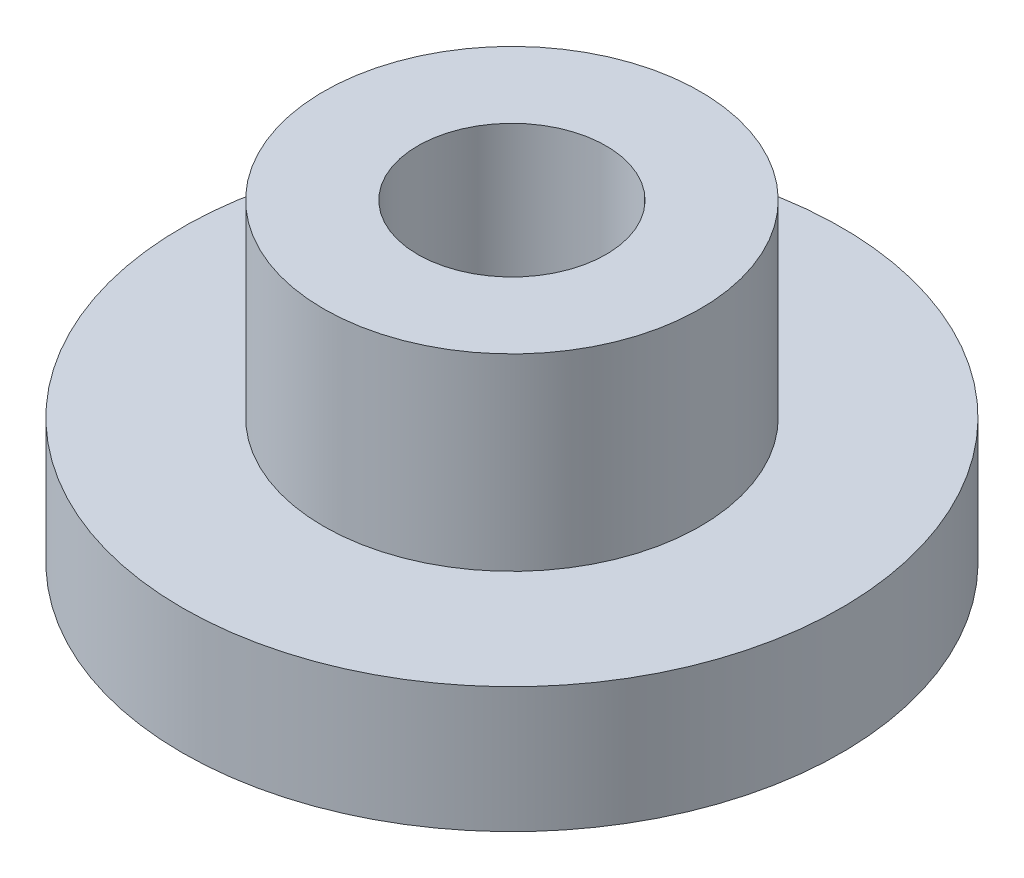
ISO-10303-21;
HEADER;
FILE_DESCRIPTION(('STEP AP214'),'2;1');
FILE_NAME('part.step','',(''),(''),'','','');
FILE_SCHEMA(('AUTOMOTIVE_DESIGN { 1 0 10303 214 1 1 1 1 }'));
ENDSEC;
DATA;
#1=APPLICATION_CONTEXT('core data for automotive mechanical design processes');
#2=APPLICATION_PROTOCOL_DEFINITION('international standard','automotive_design',2000,#1);
#3=PRODUCT_CONTEXT('',#1,'mechanical');
#4=PRODUCT('Part','Part','',(#3));
#5=PRODUCT_RELATED_PRODUCT_CATEGORY('part','',(#4));
#6=PRODUCT_DEFINITION_FORMATION('','',#4);
#7=PRODUCT_DEFINITION_CONTEXT('part definition',#1,'design');
#8=PRODUCT_DEFINITION('design','',#6,#7);
#9=PRODUCT_DEFINITION_SHAPE('','',#8);
#10=(LENGTH_UNIT() NAMED_UNIT(*) SI_UNIT(.MILLI.,.METRE.));
#11=(NAMED_UNIT(*) PLANE_ANGLE_UNIT() SI_UNIT($,.RADIAN.));
#12=(NAMED_UNIT(*) SI_UNIT($,.STERADIAN.) SOLID_ANGLE_UNIT());
#13=UNCERTAINTY_MEASURE_WITH_UNIT(LENGTH_MEASURE(1.E-05),#10,'distance_accuracy_value','');
#14=(GEOMETRIC_REPRESENTATION_CONTEXT(3) GLOBAL_UNCERTAINTY_ASSIGNED_CONTEXT((#13)) GLOBAL_UNIT_ASSIGNED_CONTEXT((#10,
#11,#12)) REPRESENTATION_CONTEXT('',''));
#15=CARTESIAN_POINT('',(0.,0.,0.));
#16=DIRECTION('',(0.,0.,1.));
#17=DIRECTION('',(1.,0.,0.));
#18=AXIS2_PLACEMENT_3D('',#15,#16,#17);
#19=CARTESIAN_POINT('',(0.,-2.,0.));
#20=DIRECTION('',(0.,-1.,0.));
#21=DIRECTION('',(0.,0.,-1.));
#22=AXIS2_PLACEMENT_3D('',#19,#20,#21);
#23=PLANE('',#22);
#24=CARTESIAN_POINT('',(0.,-2.,0.));
#25=DIRECTION('',(0.,1.,0.));
#26=DIRECTION('',(0.,0.,1.));
#27=AXIS2_PLACEMENT_3D('',#24,#25,#26);
#28=CIRCLE('',#27,5.24999999999999);
#29=CARTESIAN_POINT('',(0.,-2.,5.24999999999999));
#30=VERTEX_POINT('',#29);
#31=EDGE_CURVE('E11',#30,#30,#28,.T.);
#32=ORIENTED_EDGE('',*,*,#31,.F.);
#33=EDGE_LOOP('',(#32));
#34=FACE_BOUND('',#33,.T.);
#35=ADVANCED_FACE('F32',(#34),#23,.T.);
#36=CARTESIAN_POINT('',(0.,27.2702561117579,0.));
#37=DIRECTION('',(0.,1.,0.));
#38=DIRECTION('',(0.,0.,1.));
#39=AXIS2_PLACEMENT_3D('',#36,#37,#38);
#40=CYLINDRICAL_SURFACE('',#39,5.24999999999999);
#41=ORIENTED_EDGE('',*,*,#31,.T.);
#42=EDGE_LOOP('',(#41));
#43=FACE_BOUND('',#42,.T.);
#44=CARTESIAN_POINT('',(0.,0.,0.));
#45=DIRECTION('',(0.,1.,0.));
#46=DIRECTION('',(0.,0.,1.));
#47=AXIS2_PLACEMENT_3D('',#44,#45,#46);
#48=CIRCLE('',#47,5.24999999999999);
#49=CARTESIAN_POINT('',(0.,0.,5.24999999999999));
#50=VERTEX_POINT('',#49);
#51=EDGE_CURVE('E38',#50,#50,#48,.T.);
#52=ORIENTED_EDGE('',*,*,#51,.F.);
#53=EDGE_LOOP('',(#52));
#54=FACE_BOUND('',#53,.T.);
#55=ADVANCED_FACE('F54',(#43,#54),#40,.T.);
#56=CARTESIAN_POINT('',(-5.24999999999999,0.,0.));
#57=DIRECTION('',(0.,1.,0.));
#58=DIRECTION('',(0.,0.,1.));
#59=AXIS2_PLACEMENT_3D('',#56,#57,#58);
#60=PLANE('',#59);
#61=ORIENTED_EDGE('',*,*,#51,.T.);
#62=EDGE_LOOP('',(#61));
#63=FACE_BOUND('',#62,.T.);
#64=CARTESIAN_POINT('',(0.,0.,0.));
#65=DIRECTION('',(0.,1.,0.));
#66=DIRECTION('',(0.,0.,1.));
#67=AXIS2_PLACEMENT_3D('',#64,#65,#66);
#68=CIRCLE('',#67,3.);
#69=CARTESIAN_POINT('',(0.,0.,3.));
#70=VERTEX_POINT('',#69);
#71=EDGE_CURVE('E66',#70,#70,#68,.T.);
#72=ORIENTED_EDGE('',*,*,#71,.F.);
#73=EDGE_LOOP('',(#72));
#74=FACE_BOUND('',#73,.T.);
#75=ADVANCED_FACE('F59',(#63,#74),#60,.T.);
#76=CARTESIAN_POINT('',(0.,27.2702561117579,0.));
#77=DIRECTION('',(0.,1.,0.));
#78=DIRECTION('',(0.,0.,1.));
#79=AXIS2_PLACEMENT_3D('',#76,#77,#78);
#80=CYLINDRICAL_SURFACE('',#79,3.);
#81=ORIENTED_EDGE('',*,*,#71,.T.);
#82=EDGE_LOOP('',(#81));
#83=FACE_BOUND('',#82,.T.);
#84=CARTESIAN_POINT('',(0.,3.,0.));
#85=DIRECTION('',(0.,1.,0.));
#86=DIRECTION('',(0.,0.,1.));
#87=AXIS2_PLACEMENT_3D('',#84,#85,#86);
#88=CIRCLE('',#87,3.);
#89=CARTESIAN_POINT('',(0.,3.,3.));
#90=VERTEX_POINT('',#89);
#91=EDGE_CURVE('E68',#90,#90,#88,.T.);
#92=ORIENTED_EDGE('',*,*,#91,.F.);
#93=EDGE_LOOP('',(#92));
#94=FACE_BOUND('',#93,.T.);
#95=ADVANCED_FACE('F82',(#83,#94),#80,.T.);
#96=CARTESIAN_POINT('',(-3.,3.,0.));
#97=DIRECTION('',(0.,1.,0.));
#98=DIRECTION('',(0.,0.,1.));
#99=AXIS2_PLACEMENT_3D('',#96,#97,#98);
#100=PLANE('',#99);
#101=ORIENTED_EDGE('',*,*,#91,.T.);
#102=EDGE_LOOP('',(#101));
#103=FACE_BOUND('',#102,.T.);
#104=CARTESIAN_POINT('',(0.,3.,0.));
#105=DIRECTION('',(0.,1.,0.));
#106=DIRECTION('',(0.,0.,1.));
#107=AXIS2_PLACEMENT_3D('',#104,#105,#106);
#108=CIRCLE('',#107,1.5);
#109=CARTESIAN_POINT('',(0.,3.,1.5));
#110=VERTEX_POINT('',#109);
#111=EDGE_CURVE('E73',#110,#110,#108,.T.);
#112=ORIENTED_EDGE('',*,*,#111,.F.);
#113=EDGE_LOOP('',(#112));
#114=FACE_BOUND('',#113,.T.);
#115=ADVANCED_FACE('F49',(#103,#114),#100,.T.);
#116=CARTESIAN_POINT('',(0.,27.2702561117579,0.));
#117=DIRECTION('',(0.,1.,0.));
#118=DIRECTION('',(0.,0.,1.));
#119=AXIS2_PLACEMENT_3D('',#116,#117,#118);
#120=CYLINDRICAL_SURFACE('',#119,1.5);
#121=ORIENTED_EDGE('',*,*,#111,.T.);
#122=EDGE_LOOP('',(#121));
#123=FACE_BOUND('',#122,.T.);
#124=CARTESIAN_POINT('',(0.,0.866025403784432,0.));
#125=DIRECTION('',(0.,1.,0.));
#126=DIRECTION('',(0.,0.,1.));
#127=AXIS2_PLACEMENT_3D('',#124,#125,#126);
#128=CIRCLE('',#127,1.5);
#129=CARTESIAN_POINT('',(0.,0.866025403784432,1.5));
#130=VERTEX_POINT('',#129);
#131=EDGE_CURVE('E76',#130,#130,#128,.T.);
#132=ORIENTED_EDGE('',*,*,#131,.F.);
#133=EDGE_LOOP('',(#132));
#134=FACE_BOUND('',#133,.T.);
#135=ADVANCED_FACE('F43',(#123,#134),#120,.F.);
#136=CARTESIAN_POINT('',(0.,0.,0.));
#137=DIRECTION('',(0.,1.,0.));
#138=DIRECTION('',(0.,0.,1.));
#139=AXIS2_PLACEMENT_3D('',#136,#137,#138);
#140=CONICAL_SURFACE('',#139,0.,1.0471975511966);
#141=ORIENTED_EDGE('',*,*,#131,.T.);
#142=EDGE_LOOP('',(#141));
#143=FACE_BOUND('',#142,.T.);
#144=CARTESIAN_POINT('',(0.,0.,0.));
#145=VERTEX_POINT('',#144);
#146=VERTEX_LOOP('',#145);
#147=FACE_BOUND('',#146,.T.);
#148=ADVANCED_FACE('F41',(#143,#147),#140,.F.);
#149=CLOSED_SHELL('',(#35,#55,#75,#95,#115,#135,#148));
#150=MANIFOLD_SOLID_BREP('B2',#149);
#151=ADVANCED_BREP_SHAPE_REPRESENTATION('',(#18,#150),#14);
#152=SHAPE_DEFINITION_REPRESENTATION(#9,#151);
ENDSEC;
END-ISO-10303-21;
